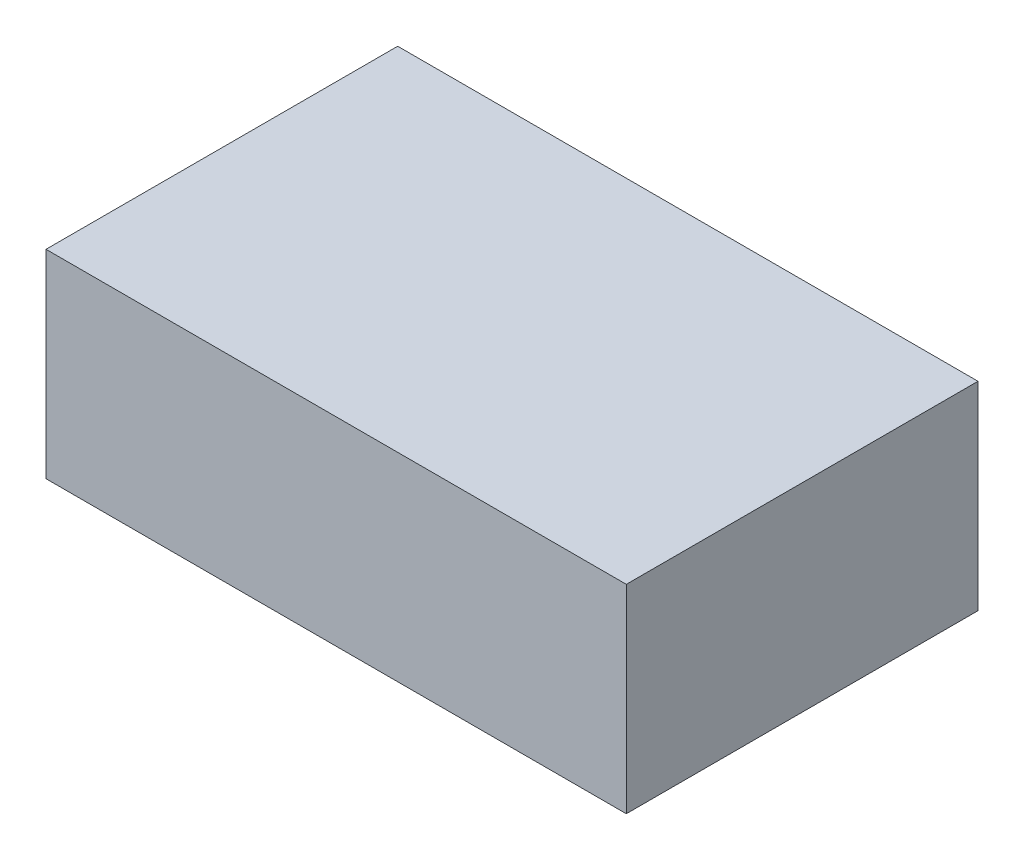
ISO-10303-21;
HEADER;
FILE_DESCRIPTION(('STEP AP214'),'2;1');
FILE_NAME('part.step','',(''),(''),'','','');
FILE_SCHEMA(('AUTOMOTIVE_DESIGN { 1 0 10303 214 1 1 1 1 }'));
ENDSEC;
DATA;
#1=APPLICATION_CONTEXT('core data for automotive mechanical design processes');
#2=APPLICATION_PROTOCOL_DEFINITION('international standard','automotive_design',2000,#1);
#3=PRODUCT_CONTEXT('',#1,'mechanical');
#4=PRODUCT('Part','Part','',(#3));
#5=PRODUCT_RELATED_PRODUCT_CATEGORY('part','',(#4));
#6=PRODUCT_DEFINITION_FORMATION('','',#4);
#7=PRODUCT_DEFINITION_CONTEXT('part definition',#1,'design');
#8=PRODUCT_DEFINITION('design','',#6,#7);
#9=PRODUCT_DEFINITION_SHAPE('','',#8);
#10=(LENGTH_UNIT() NAMED_UNIT(*) SI_UNIT(.MILLI.,.METRE.));
#11=(NAMED_UNIT(*) PLANE_ANGLE_UNIT() SI_UNIT($,.RADIAN.));
#12=(NAMED_UNIT(*) SI_UNIT($,.STERADIAN.) SOLID_ANGLE_UNIT());
#13=UNCERTAINTY_MEASURE_WITH_UNIT(LENGTH_MEASURE(1.E-05),#10,'distance_accuracy_value','');
#14=(GEOMETRIC_REPRESENTATION_CONTEXT(3) GLOBAL_UNCERTAINTY_ASSIGNED_CONTEXT((#13)) GLOBAL_UNIT_ASSIGNED_CONTEXT((#10,
#11,#12)) REPRESENTATION_CONTEXT('',''));
#15=CARTESIAN_POINT('',(0.,0.,0.));
#16=DIRECTION('',(0.,0.,1.));
#17=DIRECTION('',(1.,0.,0.));
#18=AXIS2_PLACEMENT_3D('',#15,#16,#17);
#19=CARTESIAN_POINT('',(-16.5,5.65,-10.));
#20=DIRECTION('',(1.,0.,0.));
#21=DIRECTION('',(0.,0.,-1.));
#22=AXIS2_PLACEMENT_3D('',#19,#20,#21);
#23=PLANE('',#22);
#24=DIRECTION('',(0.,0.,1.));
#25=VECTOR('',#24,1.);
#26=CARTESIAN_POINT('',(-16.5,-5.65,-10.));
#27=LINE('',#26,#25);
#28=CARTESIAN_POINT('',(-16.5,-5.65,-10.));
#29=VERTEX_POINT('',#28);
#30=CARTESIAN_POINT('',(-16.5,-5.65,10.));
#31=VERTEX_POINT('',#30);
#32=EDGE_CURVE('E113',#29,#31,#27,.T.);
#33=ORIENTED_EDGE('',*,*,#32,.T.);
#34=DIRECTION('',(0.,-1.,0.));
#35=VECTOR('',#34,1.);
#36=CARTESIAN_POINT('',(-16.5,5.65,10.));
#37=LINE('',#36,#35);
#38=CARTESIAN_POINT('',(-16.5,5.65,10.));
#39=VERTEX_POINT('',#38);
#40=EDGE_CURVE('E11',#39,#31,#37,.T.);
#41=ORIENTED_EDGE('',*,*,#40,.F.);
#42=DIRECTION('',(0.,0.,1.));
#43=VECTOR('',#42,1.);
#44=CARTESIAN_POINT('',(-16.5,5.65,-10.));
#45=LINE('',#44,#43);
#46=CARTESIAN_POINT('',(-16.5,5.65,-10.));
#47=VERTEX_POINT('',#46);
#48=EDGE_CURVE('E97',#47,#39,#45,.T.);
#49=ORIENTED_EDGE('',*,*,#48,.F.);
#50=DIRECTION('',(0.,-1.,0.));
#51=VECTOR('',#50,1.);
#52=CARTESIAN_POINT('',(-16.5,5.65,-10.));
#53=LINE('',#52,#51);
#54=EDGE_CURVE('E109',#47,#29,#53,.T.);
#55=ORIENTED_EDGE('',*,*,#54,.T.);
#56=EDGE_LOOP('',(#33,#41,#49,#55));
#57=FACE_BOUND('',#56,.T.);
#58=ADVANCED_FACE('F45',(#57),#23,.F.);
#59=CARTESIAN_POINT('',(-16.5,5.65,10.));
#60=DIRECTION('',(0.,0.,-1.));
#61=DIRECTION('',(-1.,0.,0.));
#62=AXIS2_PLACEMENT_3D('',#59,#60,#61);
#63=PLANE('',#62);
#64=DIRECTION('',(1.,0.,0.));
#65=VECTOR('',#64,1.);
#66=CARTESIAN_POINT('',(-16.5,-5.65,10.));
#67=LINE('',#66,#65);
#68=CARTESIAN_POINT('',(16.5,-5.65,10.));
#69=VERTEX_POINT('',#68);
#70=EDGE_CURVE('E102',#31,#69,#67,.T.);
#71=ORIENTED_EDGE('',*,*,#70,.T.);
#72=DIRECTION('',(0.,-1.,0.));
#73=VECTOR('',#72,1.);
#74=CARTESIAN_POINT('',(16.5,5.65,10.));
#75=LINE('',#74,#73);
#76=CARTESIAN_POINT('',(16.5,5.65,10.));
#77=VERTEX_POINT('',#76);
#78=EDGE_CURVE('E54',#77,#69,#75,.T.);
#79=ORIENTED_EDGE('',*,*,#78,.F.);
#80=DIRECTION('',(1.,0.,0.));
#81=VECTOR('',#80,1.);
#82=CARTESIAN_POINT('',(-16.5,5.65,10.));
#83=LINE('',#82,#81);
#84=EDGE_CURVE('E92',#39,#77,#83,.T.);
#85=ORIENTED_EDGE('',*,*,#84,.F.);
#86=ORIENTED_EDGE('',*,*,#40,.T.);
#87=EDGE_LOOP('',(#71,#79,#85,#86));
#88=FACE_BOUND('',#87,.T.);
#89=ADVANCED_FACE('F101',(#88),#63,.F.);
#90=CARTESIAN_POINT('',(16.5,5.65,-10.));
#91=DIRECTION('',(-1.,0.,0.));
#92=DIRECTION('',(0.,0.,1.));
#93=AXIS2_PLACEMENT_3D('',#90,#91,#92);
#94=PLANE('',#93);
#95=DIRECTION('',(0.,0.,-1.));
#96=VECTOR('',#95,1.);
#97=CARTESIAN_POINT('',(16.5,-5.65,-10.));
#98=LINE('',#97,#96);
#99=CARTESIAN_POINT('',(16.5,-5.65,-10.));
#100=VERTEX_POINT('',#99);
#101=EDGE_CURVE('E79',#69,#100,#98,.T.);
#102=ORIENTED_EDGE('',*,*,#101,.T.);
#103=DIRECTION('',(0.,-1.,0.));
#104=VECTOR('',#103,1.);
#105=CARTESIAN_POINT('',(16.5,5.65,-10.));
#106=LINE('',#105,#104);
#107=CARTESIAN_POINT('',(16.5,5.65,-10.));
#108=VERTEX_POINT('',#107);
#109=EDGE_CURVE('E104',#108,#100,#106,.T.);
#110=ORIENTED_EDGE('',*,*,#109,.F.);
#111=DIRECTION('',(0.,0.,-1.));
#112=VECTOR('',#111,1.);
#113=CARTESIAN_POINT('',(16.5,5.65,-10.));
#114=LINE('',#113,#112);
#115=EDGE_CURVE('E95',#77,#108,#114,.T.);
#116=ORIENTED_EDGE('',*,*,#115,.F.);
#117=ORIENTED_EDGE('',*,*,#78,.T.);
#118=EDGE_LOOP('',(#102,#110,#116,#117));
#119=FACE_BOUND('',#118,.T.);
#120=ADVANCED_FACE('F105',(#119),#94,.F.);
#121=CARTESIAN_POINT('',(-16.5,5.65,-10.));
#122=DIRECTION('',(0.,0.,1.));
#123=DIRECTION('',(1.,0.,0.));
#124=AXIS2_PLACEMENT_3D('',#121,#122,#123);
#125=PLANE('',#124);
#126=DIRECTION('',(-1.,0.,0.));
#127=VECTOR('',#126,1.);
#128=CARTESIAN_POINT('',(-16.5,-5.65,-10.));
#129=LINE('',#128,#127);
#130=EDGE_CURVE('E85',#100,#29,#129,.T.);
#131=ORIENTED_EDGE('',*,*,#130,.T.);
#132=ORIENTED_EDGE('',*,*,#54,.F.);
#133=DIRECTION('',(-1.,0.,0.));
#134=VECTOR('',#133,1.);
#135=CARTESIAN_POINT('',(-16.5,5.65,-10.));
#136=LINE('',#135,#134);
#137=EDGE_CURVE('E62',#108,#47,#136,.T.);
#138=ORIENTED_EDGE('',*,*,#137,.F.);
#139=ORIENTED_EDGE('',*,*,#109,.T.);
#140=EDGE_LOOP('',(#131,#132,#138,#139));
#141=FACE_BOUND('',#140,.T.);
#142=ADVANCED_FACE('F126',(#141),#125,.F.);
#143=CARTESIAN_POINT('',(0.,5.65,0.));
#144=DIRECTION('',(0.,1.,0.));
#145=DIRECTION('',(0.,0.,1.));
#146=AXIS2_PLACEMENT_3D('',#143,#144,#145);
#147=PLANE('',#146);
#148=ORIENTED_EDGE('',*,*,#48,.T.);
#149=ORIENTED_EDGE('',*,*,#84,.T.);
#150=ORIENTED_EDGE('',*,*,#115,.T.);
#151=ORIENTED_EDGE('',*,*,#137,.T.);
#152=EDGE_LOOP('',(#148,#149,#150,#151));
#153=FACE_BOUND('',#152,.T.);
#154=ADVANCED_FACE('F93',(#153),#147,.T.);
#155=CARTESIAN_POINT('',(0.,-5.65,0.));
#156=DIRECTION('',(0.,1.,0.));
#157=DIRECTION('',(0.,0.,1.));
#158=AXIS2_PLACEMENT_3D('',#155,#156,#157);
#159=PLANE('',#158);
#160=ORIENTED_EDGE('',*,*,#32,.F.);
#161=ORIENTED_EDGE('',*,*,#130,.F.);
#162=ORIENTED_EDGE('',*,*,#101,.F.);
#163=ORIENTED_EDGE('',*,*,#70,.F.);
#164=EDGE_LOOP('',(#160,#161,#162,#163));
#165=FACE_BOUND('',#164,.T.);
#166=ADVANCED_FACE('F129',(#165),#159,.F.);
#167=CLOSED_SHELL('',(#58,#89,#120,#142,#154,#166));
#168=MANIFOLD_SOLID_BREP('B2',#167);
#169=ADVANCED_BREP_SHAPE_REPRESENTATION('',(#18,#168),#14);
#170=SHAPE_DEFINITION_REPRESENTATION(#9,#169);
ENDSEC;
END-ISO-10303-21;
